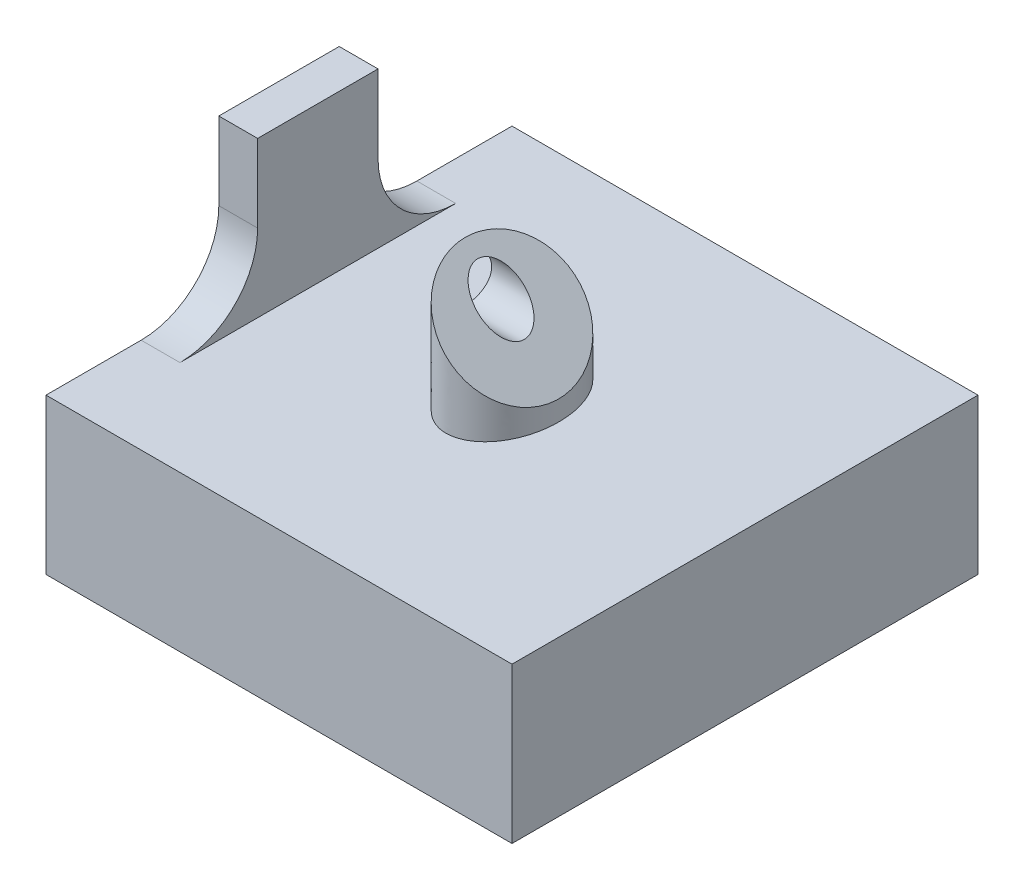
ISO-10303-21;
HEADER;
FILE_DESCRIPTION(('STEP AP214'),'2;1');
FILE_NAME('part.step','',(''),(''),'','','');
FILE_SCHEMA(('AUTOMOTIVE_DESIGN { 1 0 10303 214 1 1 1 1 }'));
ENDSEC;
DATA;
#1=APPLICATION_CONTEXT('core data for automotive mechanical design processes');
#2=APPLICATION_PROTOCOL_DEFINITION('international standard','automotive_design',2000,#1);
#3=PRODUCT_CONTEXT('',#1,'mechanical');
#4=PRODUCT('Part','Part','',(#3));
#5=PRODUCT_RELATED_PRODUCT_CATEGORY('part','',(#4));
#6=PRODUCT_DEFINITION_FORMATION('','',#4);
#7=PRODUCT_DEFINITION_CONTEXT('part definition',#1,'design');
#8=PRODUCT_DEFINITION('design','',#6,#7);
#9=PRODUCT_DEFINITION_SHAPE('','',#8);
#10=(LENGTH_UNIT() NAMED_UNIT(*) SI_UNIT(.MILLI.,.METRE.));
#11=(NAMED_UNIT(*) PLANE_ANGLE_UNIT() SI_UNIT($,.RADIAN.));
#12=(NAMED_UNIT(*) SI_UNIT($,.STERADIAN.) SOLID_ANGLE_UNIT());
#13=UNCERTAINTY_MEASURE_WITH_UNIT(LENGTH_MEASURE(1.E-05),#10,'distance_accuracy_value','');
#14=(GEOMETRIC_REPRESENTATION_CONTEXT(3) GLOBAL_UNCERTAINTY_ASSIGNED_CONTEXT((#13)) GLOBAL_UNIT_ASSIGNED_CONTEXT((#10,
#11,#12)) REPRESENTATION_CONTEXT('',''));
#15=CARTESIAN_POINT('',(0.,0.,0.));
#16=DIRECTION('',(0.,0.,1.));
#17=DIRECTION('',(1.,0.,0.));
#18=AXIS2_PLACEMENT_3D('',#15,#16,#17);
#19=CARTESIAN_POINT('',(0.,20.,0.));
#20=DIRECTION('',(0.,1.,0.));
#21=DIRECTION('',(0.,0.,1.));
#22=AXIS2_PLACEMENT_3D('',#19,#20,#21);
#23=PLANE('',#22);
#24=CARTESIAN_POINT('',(0.,20.,0.));
#25=DIRECTION('',(0.,1.,0.));
#26=DIRECTION('',(0.,0.,-1.));
#27=AXIS2_PLACEMENT_3D('',#24,#25,#26);
#28=ELLIPSE('',#27,8.5,6.01040764008565);
#29=CARTESIAN_POINT('',(0.,20.,-8.5));
#30=VERTEX_POINT('',#29);
#31=EDGE_CURVE('E151',#30,#30,#28,.T.);
#32=ORIENTED_EDGE('',*,*,#31,.F.);
#33=EDGE_LOOP('',(#32));
#34=FACE_BOUND('',#33,.T.);
#35=DIRECTION('',(0.,0.,1.));
#36=VECTOR('',#35,1.);
#37=CARTESIAN_POINT('',(-30.,20.,-30.));
#38=LINE('',#37,#36);
#39=CARTESIAN_POINT('',(-30.,20.,-30.));
#40=VERTEX_POINT('',#39);
#41=CARTESIAN_POINT('',(-30.,20.,-17.75));
#42=VERTEX_POINT('',#41);
#43=EDGE_CURVE('E155',#40,#42,#38,.T.);
#44=ORIENTED_EDGE('',*,*,#43,.T.);
#45=DIRECTION('',(-1.,0.,0.));
#46=VECTOR('',#45,1.);
#47=CARTESIAN_POINT('',(0.,20.,-17.75));
#48=LINE('',#47,#46);
#49=CARTESIAN_POINT('',(-25.,20.,-17.75));
#50=VERTEX_POINT('',#49);
#51=EDGE_CURVE('E247',#42,#50,#48,.F.);
#52=ORIENTED_EDGE('',*,*,#51,.T.);
#53=DIRECTION('',(0.,0.,-1.));
#54=VECTOR('',#53,1.);
#55=CARTESIAN_POINT('',(-25.,20.,7.75));
#56=LINE('',#55,#54);
#57=CARTESIAN_POINT('',(-25.,20.,17.75));
#58=VERTEX_POINT('',#57);
#59=EDGE_CURVE('E135',#58,#50,#56,.T.);
#60=ORIENTED_EDGE('',*,*,#59,.F.);
#61=DIRECTION('',(1.,0.,0.));
#62=VECTOR('',#61,1.);
#63=CARTESIAN_POINT('',(0.,20.,17.75));
#64=LINE('',#63,#62);
#65=CARTESIAN_POINT('',(-30.,20.,17.75));
#66=VERTEX_POINT('',#65);
#67=EDGE_CURVE('E246',#58,#66,#64,.F.);
#68=ORIENTED_EDGE('',*,*,#67,.T.);
#69=CARTESIAN_POINT('',(-30.,20.,30.));
#70=VERTEX_POINT('',#69);
#71=EDGE_CURVE('E159',#66,#70,#38,.T.);
#72=ORIENTED_EDGE('',*,*,#71,.T.);
#73=DIRECTION('',(1.,0.,0.));
#74=VECTOR('',#73,1.);
#75=CARTESIAN_POINT('',(-30.,20.,30.));
#76=LINE('',#75,#74);
#77=CARTESIAN_POINT('',(30.,20.,30.));
#78=VERTEX_POINT('',#77);
#79=EDGE_CURVE('E158',#70,#78,#76,.T.);
#80=ORIENTED_EDGE('',*,*,#79,.T.);
#81=DIRECTION('',(0.,0.,-1.));
#82=VECTOR('',#81,1.);
#83=CARTESIAN_POINT('',(30.,20.,-30.));
#84=LINE('',#83,#82);
#85=CARTESIAN_POINT('',(30.,20.,-30.));
#86=VERTEX_POINT('',#85);
#87=EDGE_CURVE('E161',#78,#86,#84,.T.);
#88=ORIENTED_EDGE('',*,*,#87,.T.);
#89=DIRECTION('',(-1.,0.,0.));
#90=VECTOR('',#89,1.);
#91=CARTESIAN_POINT('',(-30.,20.,-30.));
#92=LINE('',#91,#90);
#93=EDGE_CURVE('E163',#86,#40,#92,.T.);
#94=ORIENTED_EDGE('',*,*,#93,.T.);
#95=EDGE_LOOP('',(#44,#52,#60,#68,#72,#80,#88,#94));
#96=FACE_BOUND('',#95,.T.);
#97=ADVANCED_FACE('F40',(#34,#96),#23,.T.);
#98=CARTESIAN_POINT('',(-30.,20.,-30.));
#99=DIRECTION('',(1.,0.,0.));
#100=DIRECTION('',(0.,0.,-1.));
#101=AXIS2_PLACEMENT_3D('',#98,#99,#100);
#102=PLANE('',#101);
#103=DIRECTION('',(0.,0.,1.));
#104=VECTOR('',#103,1.);
#105=CARTESIAN_POINT('',(-30.,0.,-30.));
#106=LINE('',#105,#104);
#107=CARTESIAN_POINT('',(-30.,0.,-30.));
#108=VERTEX_POINT('',#107);
#109=CARTESIAN_POINT('',(-30.,0.,30.));
#110=VERTEX_POINT('',#109);
#111=EDGE_CURVE('E154',#108,#110,#106,.T.);
#112=ORIENTED_EDGE('',*,*,#111,.T.);
#113=DIRECTION('',(0.,-1.,0.));
#114=VECTOR('',#113,1.);
#115=CARTESIAN_POINT('',(-30.,20.,30.));
#116=LINE('',#115,#114);
#117=EDGE_CURVE('E181',#70,#110,#116,.T.);
#118=ORIENTED_EDGE('',*,*,#117,.F.);
#119=ORIENTED_EDGE('',*,*,#71,.F.);
#120=CARTESIAN_POINT('',(-30.,30.,17.75));
#121=DIRECTION('',(1.,0.,0.));
#122=DIRECTION('',(0.,0.,-1.));
#123=AXIS2_PLACEMENT_3D('',#120,#121,#122);
#124=CIRCLE('',#123,10.);
#125=CARTESIAN_POINT('',(-30.,30.,7.75));
#126=VERTEX_POINT('',#125);
#127=EDGE_CURVE('E12',#66,#126,#124,.T.);
#128=ORIENTED_EDGE('',*,*,#127,.T.);
#129=DIRECTION('',(0.,-1.,0.));
#130=VECTOR('',#129,1.);
#131=CARTESIAN_POINT('',(-30.,40.,7.75));
#132=LINE('',#131,#130);
#133=CARTESIAN_POINT('',(-30.,40.,7.75));
#134=VERTEX_POINT('',#133);
#135=EDGE_CURVE('E121',#134,#126,#132,.T.);
#136=ORIENTED_EDGE('',*,*,#135,.F.);
#137=DIRECTION('',(0.,0.,1.));
#138=VECTOR('',#137,1.);
#139=CARTESIAN_POINT('',(-30.,40.,7.75));
#140=LINE('',#139,#138);
#141=CARTESIAN_POINT('',(-30.,40.,-7.75));
#142=VERTEX_POINT('',#141);
#143=EDGE_CURVE('E127',#142,#134,#140,.T.);
#144=ORIENTED_EDGE('',*,*,#143,.F.);
#145=DIRECTION('',(0.,-1.,0.));
#146=VECTOR('',#145,1.);
#147=CARTESIAN_POINT('',(-30.,40.,-7.75));
#148=LINE('',#147,#146);
#149=CARTESIAN_POINT('',(-30.,30.,-7.75));
#150=VERTEX_POINT('',#149);
#151=EDGE_CURVE('E235',#142,#150,#148,.T.);
#152=ORIENTED_EDGE('',*,*,#151,.T.);
#153=CARTESIAN_POINT('',(-30.,30.,-17.75));
#154=DIRECTION('',(1.,0.,0.));
#155=DIRECTION('',(0.,0.,-1.));
#156=AXIS2_PLACEMENT_3D('',#153,#154,#155);
#157=CIRCLE('',#156,10.);
#158=EDGE_CURVE('E245',#150,#42,#157,.T.);
#159=ORIENTED_EDGE('',*,*,#158,.T.);
#160=ORIENTED_EDGE('',*,*,#43,.F.);
#161=DIRECTION('',(0.,-1.,0.));
#162=VECTOR('',#161,1.);
#163=CARTESIAN_POINT('',(-30.,20.,-30.));
#164=LINE('',#163,#162);
#165=EDGE_CURVE('E165',#40,#108,#164,.T.);
#166=ORIENTED_EDGE('',*,*,#165,.T.);
#167=EDGE_LOOP('',(#112,#118,#119,#128,#136,#144,#152,#159,#160,#166));
#168=FACE_BOUND('',#167,.T.);
#169=ADVANCED_FACE('F138',(#168),#102,.F.);
#170=CARTESIAN_POINT('',(-30.,20.,30.));
#171=DIRECTION('',(0.,0.,-1.));
#172=DIRECTION('',(-1.,0.,0.));
#173=AXIS2_PLACEMENT_3D('',#170,#171,#172);
#174=PLANE('',#173);
#175=DIRECTION('',(1.,0.,0.));
#176=VECTOR('',#175,1.);
#177=CARTESIAN_POINT('',(-30.,0.,30.));
#178=LINE('',#177,#176);
#179=CARTESIAN_POINT('',(30.,0.,30.));
#180=VERTEX_POINT('',#179);
#181=EDGE_CURVE('E167',#110,#180,#178,.T.);
#182=ORIENTED_EDGE('',*,*,#181,.T.);
#183=DIRECTION('',(0.,-1.,0.));
#184=VECTOR('',#183,1.);
#185=CARTESIAN_POINT('',(30.,20.,30.));
#186=LINE('',#185,#184);
#187=EDGE_CURVE('E178',#78,#180,#186,.T.);
#188=ORIENTED_EDGE('',*,*,#187,.F.);
#189=ORIENTED_EDGE('',*,*,#79,.F.);
#190=ORIENTED_EDGE('',*,*,#117,.T.);
#191=EDGE_LOOP('',(#182,#188,#189,#190));
#192=FACE_BOUND('',#191,.T.);
#193=ADVANCED_FACE('F265',(#192),#174,.F.);
#194=CARTESIAN_POINT('',(30.,20.,-30.));
#195=DIRECTION('',(-1.,0.,0.));
#196=DIRECTION('',(0.,0.,1.));
#197=AXIS2_PLACEMENT_3D('',#194,#195,#196);
#198=PLANE('',#197);
#199=DIRECTION('',(0.,0.,-1.));
#200=VECTOR('',#199,1.);
#201=CARTESIAN_POINT('',(30.,0.,-30.));
#202=LINE('',#201,#200);
#203=CARTESIAN_POINT('',(30.,0.,-30.));
#204=VERTEX_POINT('',#203);
#205=EDGE_CURVE('E169',#180,#204,#202,.T.);
#206=ORIENTED_EDGE('',*,*,#205,.T.);
#207=DIRECTION('',(0.,-1.,0.));
#208=VECTOR('',#207,1.);
#209=CARTESIAN_POINT('',(30.,20.,-30.));
#210=LINE('',#209,#208);
#211=EDGE_CURVE('E175',#86,#204,#210,.T.);
#212=ORIENTED_EDGE('',*,*,#211,.F.);
#213=ORIENTED_EDGE('',*,*,#87,.F.);
#214=ORIENTED_EDGE('',*,*,#187,.T.);
#215=EDGE_LOOP('',(#206,#212,#213,#214));
#216=FACE_BOUND('',#215,.T.);
#217=ADVANCED_FACE('F276',(#216),#198,.F.);
#218=CARTESIAN_POINT('',(-30.,20.,-30.));
#219=DIRECTION('',(0.,0.,1.));
#220=DIRECTION('',(1.,0.,0.));
#221=AXIS2_PLACEMENT_3D('',#218,#219,#220);
#222=PLANE('',#221);
#223=DIRECTION('',(-1.,0.,0.));
#224=VECTOR('',#223,1.);
#225=CARTESIAN_POINT('',(-30.,0.,-30.));
#226=LINE('',#225,#224);
#227=EDGE_CURVE('E171',#204,#108,#226,.T.);
#228=ORIENTED_EDGE('',*,*,#227,.T.);
#229=ORIENTED_EDGE('',*,*,#165,.F.);
#230=ORIENTED_EDGE('',*,*,#93,.F.);
#231=ORIENTED_EDGE('',*,*,#211,.T.);
#232=EDGE_LOOP('',(#228,#229,#230,#231));
#233=FACE_BOUND('',#232,.T.);
#234=ADVANCED_FACE('F272',(#233),#222,.F.);
#235=CARTESIAN_POINT('',(0.,0.,0.));
#236=DIRECTION('',(0.,1.,0.));
#237=DIRECTION('',(0.,0.,1.));
#238=AXIS2_PLACEMENT_3D('',#235,#236,#237);
#239=PLANE('',#238);
#240=CARTESIAN_POINT('',(0.,0.,0.));
#241=DIRECTION('',(0.,1.,0.));
#242=DIRECTION('',(0.,0.,1.));
#243=AXIS2_PLACEMENT_3D('',#240,#241,#242);
#244=CIRCLE('',#243,2.99999999999999);
#245=CARTESIAN_POINT('',(0.,0.,2.99999999999999));
#246=VERTEX_POINT('',#245);
#247=EDGE_CURVE('E142',#246,#246,#244,.T.);
#248=ORIENTED_EDGE('',*,*,#247,.T.);
#249=EDGE_LOOP('',(#248));
#250=FACE_BOUND('',#249,.T.);
#251=ORIENTED_EDGE('',*,*,#111,.F.);
#252=ORIENTED_EDGE('',*,*,#227,.F.);
#253=ORIENTED_EDGE('',*,*,#205,.F.);
#254=ORIENTED_EDGE('',*,*,#181,.F.);
#255=EDGE_LOOP('',(#251,#252,#253,#254));
#256=FACE_BOUND('',#255,.T.);
#257=ADVANCED_FACE('F269',(#250,#256),#239,.F.);
#258=CARTESIAN_POINT('',(-6.01040764008564,36.0104076400857,0.));
#259=CARTESIAN_POINT('',(-6.01040764008565,20.,0.));
#260=CARTESIAN_POINT('',(-6.01040764008564,36.0104076400857,-17.));
#261=CARTESIAN_POINT('',(-6.01040764008564,20.,-17.));
#262=CARTESIAN_POINT('',(6.01040764008565,23.9895923599143,-17.));
#263=CARTESIAN_POINT('',(6.01040764008565,20.,-17.));
#264=CARTESIAN_POINT('',(6.01040764008565,23.9895923599143,0.));
#265=CARTESIAN_POINT('',(6.01040764008565,20.,0.));
#266=CARTESIAN_POINT('',(6.01040764008564,23.9895923599143,17.));
#267=CARTESIAN_POINT('',(6.01040764008564,20.,17.));
#268=CARTESIAN_POINT('',(-6.01040764008564,36.0104076400857,17.));
#269=CARTESIAN_POINT('',(-6.01040764008565,20.,17.));
#270=CARTESIAN_POINT('',(-6.01040764008564,36.0104076400857,0.));
#271=CARTESIAN_POINT('',(-6.01040764008565,20.,0.));
#272=(BOUNDED_SURFACE() B_SPLINE_SURFACE(3,1,((#258,#259),(#260,#261),(#262,#263),(#264,#265),
(#266,#267),(#268,#269),(#270,#271)),.UNSPECIFIED.,.T.,.F.,.F.) B_SPLINE_SURFACE_WITH_KNOTS((4,
3,4),(2,2),(0.,0.5,1.),(0.,1.),
.UNSPECIFIED.) GEOMETRIC_REPRESENTATION_ITEM() RATIONAL_B_SPLINE_SURFACE(((1.,1.),
(0.333333333333333,0.333333333333333),(0.333333333333333,0.333333333333333),(1.,1.),
(0.333333333333333,0.333333333333333),(0.333333333333333,0.333333333333333),(1.,1.))) REPRESENTATION_ITEM('') SURFACE());
#273=CARTESIAN_POINT('',(-6.01040764008564,34.5961940777126,0.));
#274=CARTESIAN_POINT('',(-6.01040988941348,34.5961963270404,0.221293380989083));
#275=CARTESIAN_POINT('',(-6.00429583049665,34.5900822681236,0.442540904981482));
#276=CARTESIAN_POINT('',(-5.97988075353075,34.5656671911577,0.883740814844157));
#277=CARTESIAN_POINT('',(-5.96157811611005,34.547364553737,1.10369302470139));
#278=CARTESIAN_POINT('',(-5.91287257758799,34.4986590152149,1.54108324112852));
#279=CARTESIAN_POINT('',(-5.88245964805662,34.4682460856835,1.75851900990467));
#280=CARTESIAN_POINT('',(-5.80972033764572,34.3955067752726,2.18937338529535));
#281=CARTESIAN_POINT('',(-5.76739354098444,34.3531799786114,2.40279185143277));
#282=CARTESIAN_POINT('',(-5.66728373661177,34.2530701742387,2.84092962690104));
#283=CARTESIAN_POINT('',(-5.60854537644019,34.1943318140671,3.0652136518266));
#284=CARTESIAN_POINT('',(-5.47791478107347,34.0637012187004,3.50599646142617));
#285=CARTESIAN_POINT('',(-5.40602171694425,33.9918081545712,3.72249475445867));
#286=CARTESIAN_POINT('',(-5.24960694148113,33.8353933791081,4.14612366321582));
#287=CARTESIAN_POINT('',(-5.16508726185124,33.7508736994782,4.3532557790467));
#288=CARTESIAN_POINT('',(-4.98398001002763,33.5697664476546,4.75678631907114));
#289=CARTESIAN_POINT('',(-4.88738823239929,33.4731746700262,4.95318096832256));
#290=CARTESIAN_POINT('',(-4.68286710929988,33.2686535469268,5.33372456208937));
#291=CARTESIAN_POINT('',(-4.57493999878973,33.1607264364167,5.51787590893865));
#292=CARTESIAN_POINT('',(-4.34849806173418,32.9342844993611,5.8726686944372));
#293=CARTESIAN_POINT('',(-4.2299830697414,32.8157695073683,6.04330992189724));
#294=CARTESIAN_POINT('',(-3.98321381578757,32.5690002534145,6.36986025664869));
#295=CARTESIAN_POINT('',(-3.85495990073288,32.4407463383598,6.5257698882449));
#296=CARTESIAN_POINT('',(-3.58961789560644,32.1754043332334,6.82175882941588));
#297=CARTESIAN_POINT('',(-3.45252960893065,32.0383160465576,6.96183778649659));
#298=CARTESIAN_POINT('',(-3.17052127034278,31.7563077079697,7.22514195208459));
#299=CARTESIAN_POINT('',(-3.02560262052262,31.6113890581495,7.348370163998));
#300=CARTESIAN_POINT('',(-2.72888964618484,31.3146760838118,7.57716625893501));
#301=CARTESIAN_POINT('',(-2.5770929584498,31.1628793960767,7.6827280125862));
#302=CARTESIAN_POINT('',(-2.26777737264762,30.8535638102745,7.87537158171805));
#303=CARTESIAN_POINT('',(-2.11025948452899,30.6960459221559,7.96245664045032));
#304=CARTESIAN_POINT('',(-1.79059364458631,30.3763800822132,8.11755236860421));
#305=CARTESIAN_POINT('',(-1.62844562071701,30.2142320583439,8.18556274104388));
#306=CARTESIAN_POINT('',(-1.30067807399745,29.8864645116244,8.3020225509917));
#307=CARTESIAN_POINT('',(-1.13505862310305,29.72084506073,8.35047239353026));
#308=CARTESIAN_POINT('',(-0.801518686921084,29.387305124548,8.42746957337003));
#309=CARTESIAN_POINT('',(-0.633598150863822,29.2193845884907,8.45601647082191));
#310=CARTESIAN_POINT('',(-0.296684801496315,28.8824712391232,8.49299964401763));
#311=CARTESIAN_POINT('',(-0.127692192925067,28.713478630552,8.50143965024513));
#312=CARTESIAN_POINT('',(0.210253755235611,28.3755326823913,8.49815937983957));
#313=CARTESIAN_POINT('',(0.37920706097091,28.206579376656,8.48643212209913));
#314=CARTESIAN_POINT('',(0.715783797929106,27.8700026396978,8.44289125598337));
#315=CARTESIAN_POINT('',(0.883407463439136,27.7023789741878,8.4110812696075));
#316=CARTESIAN_POINT('',(1.216166708182,27.3696197294449,8.32760376226224));
#317=CARTESIAN_POINT('',(1.3813022486411,27.2044841889858,8.27593593216968));
#318=CARTESIAN_POINT('',(1.70790549421302,26.8778809434139,8.15311124232917));
#319=CARTESIAN_POINT('',(1.86937326708724,26.7164131705397,8.08195474294881));
#320=CARTESIAN_POINT('',(2.18749976253722,26.3982866750897,7.92065637034144));
#321=CARTESIAN_POINT('',(2.34415837874152,26.2416280588854,7.83051407752279));
#322=CARTESIAN_POINT('',(2.65152067545436,25.9342657621725,7.6319042836799));
#323=CARTESIAN_POINT('',(2.80222544796182,25.7835609896651,7.52344016250989));
#324=CARTESIAN_POINT('',(3.09669059220651,25.4890958454204,7.28890533405452));
#325=CARTESIAN_POINT('',(3.24044854151344,25.3453378961135,7.16282854383142));
#326=CARTESIAN_POINT('',(3.51991644558225,25.0658699920446,6.89401784957366));
#327=CARTESIAN_POINT('',(3.65562785159988,24.930158586027,6.75128696309959));
#328=CARTESIAN_POINT('',(3.9180681451073,24.6677182925196,6.45016212026686));
#329=CARTESIAN_POINT('',(4.04479689274688,24.54098954488,6.29176792013936));
#330=CARTESIAN_POINT('',(4.28836625378568,24.2974201838412,5.96044755080964));
#331=CARTESIAN_POINT('',(4.40520705307447,24.1805793845524,5.7875216549195));
#332=CARTESIAN_POINT('',(4.62817501307117,23.9576114245557,5.42836069531511));
#333=CARTESIAN_POINT('',(4.73430193692697,23.8514845006999,5.24212533752339));
#334=CARTESIAN_POINT('',(4.93506615967417,23.6507202779527,4.85770838665705));
#335=CARTESIAN_POINT('',(5.02970557180049,23.5560808658264,4.65952900086676));
#336=CARTESIAN_POINT('',(5.20687565015427,23.3789107874726,4.25253079358292));
#337=CARTESIAN_POINT('',(5.28940210973756,23.2963843278893,4.04370830966289));
#338=CARTESIAN_POINT('',(5.44170696132367,23.1440794763032,3.61700942509826));
#339=CARTESIAN_POINT('',(5.51148756650727,23.0742988711196,3.39913460437486));
#340=CARTESIAN_POINT('',(5.63782238956286,22.947964048064,2.95584572663265));
#341=CARTESIAN_POINT('',(5.69437659081387,22.891409846813,2.73043166014005));
#342=CARTESIAN_POINT('',(5.79385570294,22.7919307346869,2.27367041086497));
#343=CARTESIAN_POINT('',(5.83678080915478,22.7490056284721,2.04232331316932));
#344=CARTESIAN_POINT('',(5.90869866116337,22.6770877764635,1.57533117900256));
#345=CARTESIAN_POINT('',(5.93769102525527,22.6480954123716,1.3396860249653));
#346=CARTESIAN_POINT('',(5.98153551718124,22.6042509204457,0.865779291051588));
#347=CARTESIAN_POINT('',(5.99638764515466,22.5893987924722,0.627517711200917));
#348=CARTESIAN_POINT('',(6.01184586260625,22.5739405750206,0.15007861480554));
#349=CARTESIAN_POINT('',(6.01245234232533,22.5733340953016,-0.089098876469454));
#350=CARTESIAN_POINT('',(5.99941584905181,22.5863705885751,-0.566679368141116));
#351=CARTESIAN_POINT('',(5.98577267153537,22.6000137660915,-0.805082357372171));
#352=CARTESIAN_POINT('',(5.94433357452959,22.6414528630973,-1.27941516367743));
#353=CARTESIAN_POINT('',(5.91653767282495,22.6692487648019,-1.51534498385912));
#354=CARTESIAN_POINT('',(5.84698468232586,22.738801755301,-1.98309518305011));
#355=CARTESIAN_POINT('',(5.80522516696702,22.7805612706599,-2.21491484042664));
#356=CARTESIAN_POINT('',(5.70805999796461,22.8777264396623,-2.67267448651763));
#357=CARTESIAN_POINT('',(5.65265907563272,22.9331273619942,-2.89861648383086));
#358=CARTESIAN_POINT('',(5.52858599586081,23.0572004417661,-3.343139464297));
#359=CARTESIAN_POINT('',(5.45991139591123,23.1258750417157,-3.56171908398172));
#360=CARTESIAN_POINT('',(5.30978742621707,23.2759990114098,-3.98991481613687));
#361=CARTESIAN_POINT('',(5.22833833885311,23.3574480987738,-4.19953112661134));
#362=CARTESIAN_POINT('',(5.05324168938011,23.5325447482468,-4.60831902232343));
#363=CARTESIAN_POINT('',(4.95959389886237,23.6261925387645,-4.80749041189224));
#364=CARTESIAN_POINT('',(4.76076838165695,23.8250180559699,-5.19396519577447));
#365=CARTESIAN_POINT('',(4.65559083445752,23.9301956031694,-5.38126877476713));
#366=CARTESIAN_POINT('',(4.43443226887453,24.1513541687524,-5.74271252682497));
#367=CARTESIAN_POINT('',(4.31844929653256,24.2673371410943,-5.91685030874897));
#368=CARTESIAN_POINT('',(4.07656282178548,24.5092236158414,-6.25062860325469));
#369=CARTESIAN_POINT('',(3.95066276687628,24.6351236707506,-6.4102741126366));
#370=CARTESIAN_POINT('',(3.68977777365873,24.8960086639682,-6.71402917153896));
#371=CARTESIAN_POINT('',(3.55479116417588,25.030995273451,-6.85813585044964));
#372=CARTESIAN_POINT('',(3.2767165934033,25.3090698442236,-7.1297518927569));
#373=CARTESIAN_POINT('',(3.13362881123983,25.4521576263871,-7.25726162292562));
#374=CARTESIAN_POINT('',(2.84036376079515,25.7454226768317,-7.49478316889738));
#375=CARTESIAN_POINT('',(2.69018636485371,25.8956000727732,-7.60479466945982));
#376=CARTESIAN_POINT('',(2.38381457227812,26.2019718653488,-7.80653327402106));
#377=CARTESIAN_POINT('',(2.2276202693485,26.3581661682784,-7.89826066263093));
#378=CARTESIAN_POINT('',(1.91029418024547,26.6754922573814,-8.06279594454666));
#379=CARTESIAN_POINT('',(1.74916150757762,26.8366249300493,-8.13560041846791));
#380=CARTESIAN_POINT('',(1.42318805092538,27.1625983867015,-8.26172852756671));
#381=CARTESIAN_POINT('',(1.25834856965856,27.3274378679683,-8.31505889653965));
#382=CARTESIAN_POINT('',(0.926048227516119,27.6597382101108,-8.40190318625572));
#383=CARTESIAN_POINT('',(0.758586885843098,27.8271995517838,-8.43541342763466));
#384=CARTESIAN_POINT('',(0.422267055484667,28.1635193821422,-8.48236325662698));
#385=CARTESIAN_POINT('',(0.253408597760797,28.3323778398661,-8.49580328782546));
#386=CARTESIAN_POINT('',(-0.0845116279921031,28.670298065619,-8.502518618387));
#387=CARTESIAN_POINT('',(-0.253573399502887,28.8393598371298,-8.49579356736183));
#388=CARTESIAN_POINT('',(-0.59069272595999,29.1764791635869,-8.46222605224219));
#389=CARTESIAN_POINT('',(-0.758750296497653,29.3445367341246,-8.43538390131057));
#390=CARTESIAN_POINT('',(-1.09269962402584,29.6784860616528,-8.36176664252942));
#391=CARTESIAN_POINT('',(-1.25859098043962,29.8443774180665,-8.31498790032836));
#392=CARTESIAN_POINT('',(-1.58693987506659,30.1727263126935,-8.20184921540911));
#393=CARTESIAN_POINT('',(-1.7493985818699,30.3351850194968,-8.13549605544813));
#394=CARTESIAN_POINT('',(-2.06981869308664,30.6556051307135,-7.98365897251711));
#395=CARTESIAN_POINT('',(-2.22777919818846,30.8135656358154,-7.89817125388492));
#396=CARTESIAN_POINT('',(-2.53804274088515,31.1238291785121,-7.70868244858547));
#397=CARTESIAN_POINT('',(-2.69034590340117,31.2761323410281,-7.60468177100138));
#398=CARTESIAN_POINT('',(-2.98821396815981,31.5740004057867,-7.37890643827875));
#399=CARTESIAN_POINT('',(-3.13377894728786,31.7195653849148,-7.25713198601213));
#400=CARTESIAN_POINT('',(-3.41713540866243,32.0029218462893,-6.99667600356816));
#401=CARTESIAN_POINT('',(-3.55492701217737,32.1407134498043,-6.85799473725203));
#402=CARTESIAN_POINT('',(-3.82177297130649,32.4075594089334,-6.5646948109681));
#403=CARTESIAN_POINT('',(-3.95082645264364,32.5366128902706,-6.41007456014649));
#404=CARTESIAN_POINT('',(-4.19922037954316,32.7850068171701,-6.08606377430643));
#405=CARTESIAN_POINT('',(-4.31856417123417,32.9043506088611,-5.91667836965871));
#406=CARTESIAN_POINT('',(-4.54678292488782,33.1325693625147,-5.56422933606251));
#407=CARTESIAN_POINT('',(-4.65565397899822,33.2414404166252,-5.38116064619267));
#408=CARTESIAN_POINT('',(-4.86210144936841,33.4478878869953,-5.00270487738521));
#409=CARTESIAN_POINT('',(-4.95967800956735,33.5454644471943,-4.8073179554825));
#410=CARTESIAN_POINT('',(-5.14287928315219,33.7286657207791,-4.40553569049289));
#411=CARTESIAN_POINT('',(-5.22849942573373,33.8142858633607,-4.19913617886341));
#412=CARTESIAN_POINT('',(-5.38713350909092,33.9729199467179,-3.77687001389042));
#413=CARTESIAN_POINT('',(-5.46014757503988,34.0459340126668,-3.56100345457761));
#414=CARTESIAN_POINT('',(-5.5929971289594,34.1787835665863,-3.12150987662932));
#415=CARTESIAN_POINT('',(-5.65284337576157,34.2386298133885,-2.89788936764645));
#416=CARTESIAN_POINT('',(-5.75899433922558,34.3447807768525,-2.44438729371293));
#417=CARTESIAN_POINT('',(-5.805301941293,34.3910883789199,-2.21450707428787));
#418=CARTESIAN_POINT('',(-5.89966490463282,34.4854513422598,-1.65801197788273));
#419=CARTESIAN_POINT('',(-5.94115525031384,34.5269416879408,-1.32912772786224));
#420=CARTESIAN_POINT('',(-5.99652244414413,34.5823088817711,-0.666793746883536));
#421=CARTESIAN_POINT('',(-6.01040425181511,34.596190689442,-0.333344846744702));
#422=CARTESIAN_POINT('',(-6.01040764008564,34.5961940777126,0.));
#423=B_SPLINE_CURVE_WITH_KNOTS('',3,(#273,#274,#275,#276,#277,#278,#279,#280,#281,#282,#283,
#284,#285,#286,#287,#288,#289,#290,#291,#292,#293,#294,#295,#296,#297,#298,#299,#300,#301,#302,
#303,#304,#305,#306,#307,#308,#309,#310,#311,#312,#313,#314,#315,#316,#317,#318,#319,#320,#321,
#322,#323,#324,#325,#326,#327,#328,#329,#330,#331,#332,#333,#334,#335,#336,#337,#338,#339,#340,
#341,#342,#343,#344,#345,#346,#347,#348,#349,#350,#351,#352,#353,#354,#355,#356,#357,#358,#359,
#360,#361,#362,#363,#364,#365,#366,#367,#368,#369,#370,#371,#372,#373,#374,#375,#376,#377,#378,
#379,#380,#381,#382,#383,#384,#385,#386,#387,#388,#389,#390,#391,#392,#393,#394,#395,#396,#397,
#398,#399,#400,#401,#402,#403,#404,#405,#406,#407,#408,#409,#410,#411,#412,#413,#414,#415,#416,
#417,#418,#419,#420,#421,#422),.UNSPECIFIED.,.T.,.F.,(4,2,2,2,2,2,2,2,2,2,2,2,2,2,2,2,2,2,2,2,2,
2,2,2,2,2,2,2,2,2,2,2,2,2,2,2,2,2,2,2,2,2,2,2,2,2,2,2,2,2,2,2,2,2,2,2,2,2,2,2,2,2,2,2,2,2,2,2,2,
2,2,2,2,2,4),(0.,0.663632051222431,1.32735229003642,1.99162329676368,2.65591748874353,
3.37257536034767,4.08927840718741,4.80586625584073,5.52270443440951,6.239401540073,
6.95610984688367,7.67279263607381,8.38949138015388,9.10606221588992,9.82288115256056,
10.5395741602656,11.2562783258511,11.9729676502298,12.6896728127333,13.4062449927104,
14.1230652715054,14.8397563058489,15.5564584972335,16.2731474368766,16.9898522172193,
17.7064249300881,18.423245742401,19.1399368748389,19.856639162928,20.5733279742985,
21.2900326260722,22.0066052328802,22.7234261086167,23.440122397533,24.1568195870808,
24.8735065040678,25.5902130543166,26.306919597503,27.0236065074282,27.7403037040273,
28.4570000000066,29.1738209065874,29.890393544224,30.6070981652266,31.323786945673,
32.0404891473399,32.7571801934067,33.4740010920937,34.1905738913699,34.9072788427656,
35.6239679531735,36.3406699736823,37.0573608371133,37.7741811172147,38.4907532985126,
39.2074584609521,39.9241477827786,40.6408495578628,41.3575401762841,42.0743615001247,
42.7909347284394,43.5076502273034,44.2243498907805,44.9410413744038,45.6577216741995,
46.3744735745115,47.0909774140174,47.8077475847586,48.5245086198399,49.2415429188648,
49.9585700976159,50.6750092321416,51.3912955650419,52.39113601758,53.390796845305),.UNSPECIFIED.);
#424=CARTESIAN_POINT('',(-6.01040764008564,34.5961940777126,0.));
#425=VERTEX_POINT('',#424);
#426=EDGE_CURVE('E228',#425,#425,#423,.T.);
#427=CARTESIAN_POINT('',(-6.01040764008564,33.,0.));
#428=CARTESIAN_POINT('',(-6.01040421741058,32.9999929293866,-0.165715112778276));
#429=CARTESIAN_POINT('',(-6.00694790050172,32.9862216927083,-0.331490304854222));
#430=CARTESIAN_POINT('',(-5.99347600028463,32.9315775246803,-0.658283637544941));
#431=CARTESIAN_POINT('',(-5.98345686244442,32.8906899065018,-0.819299150819029));
#432=CARTESIAN_POINT('',(-5.95792373451185,32.7832100884078,-1.13181819328137));
#433=CARTESIAN_POINT('',(-5.94241620533496,32.7166481040244,-1.28333266124222));
#434=CARTESIAN_POINT('',(-5.90750255704619,32.5598231930487,-1.57303752693712));
#435=CARTESIAN_POINT('',(-5.88809629913539,32.4695594226121,-1.71122745004377));
#436=CARTESIAN_POINT('',(-5.84700302769154,32.2659568962179,-1.97318487865312));
#437=CARTESIAN_POINT('',(-5.82528076067313,32.1522259124005,-2.09664199412243));
#438=CARTESIAN_POINT('',(-5.78219975933476,31.9057548709482,-2.32294983807676));
#439=CARTESIAN_POINT('',(-5.76084107150003,31.7730124027328,-2.4257979494487));
#440=CARTESIAN_POINT('',(-5.72056500915768,31.4897126298792,-2.60954037982359));
#441=CARTESIAN_POINT('',(-5.70169142941258,31.3389074695863,-2.69006304342129));
#442=CARTESIAN_POINT('',(-5.66909784437898,31.0253466275458,-2.82449066185297));
#443=CARTESIAN_POINT('',(-5.65537695300778,30.8625930062768,-2.87840019371952));
#444=CARTESIAN_POINT('',(-5.63507000231677,30.5332570096709,-2.95697596988832));
#445=CARTESIAN_POINT('',(-5.62834411041174,30.3668204598814,-2.98221630976236));
#446=CARTESIAN_POINT('',(-5.62241182881396,30.03195067275,-3.00451748984461));
#447=CARTESIAN_POINT('',(-5.6232041071481,29.863517794373,-3.00158332165017));
#448=CARTESIAN_POINT('',(-5.63208002831735,29.5341042224551,-2.96810339514721));
#449=CARTESIAN_POINT('',(-5.63997224124863,29.3730438731361,-2.93828251538521));
#450=CARTESIAN_POINT('',(-5.66181341184992,29.0582885706537,-2.85302839830545));
#451=CARTESIAN_POINT('',(-5.67576288277241,28.9045942428647,-2.79759299055438));
#452=CARTESIAN_POINT('',(-5.7082663979693,28.6069828307253,-2.66205485725803));
#453=CARTESIAN_POINT('',(-5.72686928967278,28.4631915411288,-2.58168812627033));
#454=CARTESIAN_POINT('',(-5.76650434364007,28.1908743646904,-2.39874609585677));
#455=CARTESIAN_POINT('',(-5.78753694010883,28.0623512147199,-2.29616682402391));
#456=CARTESIAN_POINT('',(-5.83041734420561,27.8201571795112,-2.06803836706512));
#457=CARTESIAN_POINT('',(-5.85227060811992,27.70705108142,-1.9418897664229));
#458=CARTESIAN_POINT('',(-5.8937675165352,27.5034997589214,-1.67213523999381));
#459=CARTESIAN_POINT('',(-5.91341110566185,27.4130551023387,-1.52852887690402));
#460=CARTESIAN_POINT('',(-5.94841039013852,27.2572527352112,-1.22726168944721));
#461=CARTESIAN_POINT('',(-5.96375366628573,27.1919674849113,-1.06956185854965));
#462=CARTESIAN_POINT('',(-5.98839118406566,27.0889825029677,-0.74495376923973));
#463=CARTESIAN_POINT('',(-5.99768655651242,27.0512776142889,-0.578047238595676));
#464=CARTESIAN_POINT('',(-6.00905352092328,27.0053550796506,-0.244390785250394));
#465=CARTESIAN_POINT('',(-6.01130555806312,26.9964007029633,-0.0777482467374388));
#466=CARTESIAN_POINT('',(-6.00885882028634,27.0062079170416,0.254656799565055));
#467=CARTESIAN_POINT('',(-6.00416068005522,27.0249669770347,0.420419386323948));
#468=CARTESIAN_POINT('',(-5.98842969546555,27.0890795391205,0.743864599811495));
#469=CARTESIAN_POINT('',(-5.9774901501732,27.1340415566099,0.901629765215815));
#470=CARTESIAN_POINT('',(-5.95046338569842,27.2488282948599,1.20736262352524));
#471=CARTESIAN_POINT('',(-5.93437568050112,27.3186553630896,1.35532938981467));
#472=CARTESIAN_POINT('',(-5.8983637349653,27.4825519524131,1.64009421660247));
#473=CARTESIAN_POINT('',(-5.87837810701603,27.5770188411572,1.77665561495226));
#474=CARTESIAN_POINT('',(-5.83683182481233,27.7870036474228,2.03224350644733));
#475=CARTESIAN_POINT('',(-5.81527088547847,27.9025253808586,2.15126681396077));
#476=CARTESIAN_POINT('',(-5.77232630049037,28.1547820484567,2.37147484548099));
#477=CARTESIAN_POINT('',(-5.75096058331099,28.2919753641065,2.47213882605088));
#478=CARTESIAN_POINT('',(-5.71144914274484,28.5817371476393,2.64902574279356));
#479=CARTESIAN_POINT('',(-5.69330329640435,28.7343050280815,2.7252496123242));
#480=CARTESIAN_POINT('',(-5.66253580804283,29.0498058470345,2.85057644684617));
#481=CARTESIAN_POINT('',(-5.64988550264256,29.2126798014167,2.89982049240717));
#482=CARTESIAN_POINT('',(-5.63160181317994,29.5447775878234,2.97011033092428));
#483=CARTESIAN_POINT('',(-5.62596672387838,29.7139998664083,2.99116297666159));
#484=CARTESIAN_POINT('',(-5.62250909937305,30.0484260515156,3.00413384147046));
#485=CARTESIAN_POINT('',(-5.62445348293231,30.2135950652737,2.99692122689891));
#486=CARTESIAN_POINT('',(-5.63539641879207,30.5403542829829,2.95552032101591));
#487=CARTESIAN_POINT('',(-5.64439487117798,30.7019445375905,2.92133241178546));
#488=CARTESIAN_POINT('',(-5.66227920207277,30.9375102745605,2.85092430130212));
#489=CARTESIAN_POINT('',(-5.66894638482415,31.0146836734466,2.82437061355036));
#490=CARTESIAN_POINT('',(-5.68353392425813,31.1665128663391,2.76511788360314));
#491=CARTESIAN_POINT('',(-5.69145399157092,31.2411692368672,2.73242026010199));
#492=CARTESIAN_POINT('',(-5.70832027074093,31.387462814432,2.66112157607901));
#493=CARTESIAN_POINT('',(-5.7172662459364,31.4591007125923,2.62252187639649));
#494=CARTESIAN_POINT('',(-5.73594043675926,31.5989847417981,2.5396591908835));
#495=CARTESIAN_POINT('',(-5.74566937751047,31.6672276317752,2.49539093230569));
#496=CARTESIAN_POINT('',(-5.77617550271189,31.8697840720326,2.35196347332461));
#497=CARTESIAN_POINT('',(-5.79779369489705,31.9979584730261,2.24411049920303));
#498=CARTESIAN_POINT('',(-5.84082056330374,32.2346156501427,2.00857292328779));
#499=CARTESIAN_POINT('',(-5.86222922965539,32.3430975028181,1.88088739200178));
#500=CARTESIAN_POINT('',(-5.89265137618105,32.4897615442346,1.67581512683579));
#501=CARTESIAN_POINT('',(-5.90259800142076,32.5363429203686,1.60444167846757));
#502=CARTESIAN_POINT('',(-5.92156703175926,32.623284727149,1.45794996175038));
#503=CARTESIAN_POINT('',(-5.93059026578188,32.6636507540091,1.38283514370376));
#504=CARTESIAN_POINT('',(-5.94746666314588,32.7378742910991,1.22935305540569));
#505=CARTESIAN_POINT('',(-5.95532012564735,32.7717334660516,1.1509866233072));
#506=CARTESIAN_POINT('',(-5.96964387913644,32.8326873809283,0.991550884185513));
#507=CARTESIAN_POINT('',(-5.97611406198548,32.8597815920258,0.910481366419495));
#508=CARTESIAN_POINT('',(-5.99108996187965,32.921928119935,0.69411813533958));
#509=CARTESIAN_POINT('',(-5.99828919784652,32.9511511101272,0.557003388261358));
#510=CARTESIAN_POINT('',(-6.00794930367788,32.9901893036832,0.279939909175635));
#511=CARTESIAN_POINT('',(-6.01041053146374,33.0000059730521,0.139991392045603));
#512=CARTESIAN_POINT('',(-6.01040764008564,33.,0.));
#513=B_SPLINE_CURVE_WITH_KNOTS('',3,(#427,#428,#429,#430,#431,#432,#433,#434,#435,#436,#437,
#438,#439,#440,#441,#442,#443,#444,#445,#446,#447,#448,#449,#450,#451,#452,#453,#454,#455,#456,
#457,#458,#459,#460,#461,#462,#463,#464,#465,#466,#467,#468,#469,#470,#471,#472,#473,#474,#475,
#476,#477,#478,#479,#480,#481,#482,#483,#484,#485,#486,#487,#488,#489,#490,#491,#492,#493,#494,
#495,#496,#497,#498,#499,#500,#501,#502,#503,#504,#505,#506,#507,#508,#509,#510,#511,#512),
.UNSPECIFIED.,.T.,.F.,(4,2,2,2,2,2,2,2,2,2,2,2,2,2,2,2,2,2,2,2,2,2,2,2,2,2,2,2,2,2,2,2,2,2,2,2,
2,2,2,2,2,2,4),(0.,0.496650625415146,0.993570467663019,1.4899072727217,1.98626175103589,
2.49170413724967,2.99721066837518,3.51068635929545,4.02407370982543,4.52698857544016,
5.02981434270476,5.51947620272203,6.00917956158585,6.50425655569624,6.99942216073792,
7.50952053426329,8.01963168797712,8.53120119732736,9.04267502784697,9.54093318916952,
10.0391458527022,10.5300991664285,11.0210988425522,11.5205674367596,12.0201266432712,
12.5321830037813,13.0442198067383,13.5535529154146,14.062762192626,14.5564378339209,
15.050106482866,15.2955354118348,15.5409077383742,15.7862235745906,16.0317692777812,
16.5360112250205,17.0402768116991,17.2974360880798,17.55436245054,17.8112229928161,
18.0681036079567,18.4876915627561,18.9072478195545),.UNSPECIFIED.);
#514=CARTESIAN_POINT('',(-6.01040764008564,33.,0.));
#515=VERTEX_POINT('',#514);
#516=EDGE_CURVE('E149',#515,#515,#513,.T.);
#517=ORIENTED_EDGE('',*,*,#426,.F.);
#518=EDGE_LOOP('',(#517));
#519=FACE_BOUND('',#518,.T.);
#520=ORIENTED_EDGE('',*,*,#516,.F.);
#521=EDGE_LOOP('',(#520));
#522=FACE_BOUND('',#521,.T.);
#523=ORIENTED_EDGE('',*,*,#31,.T.);
#524=EDGE_LOOP('',(#523));
#525=FACE_BOUND('',#524,.T.);
#526=ADVANCED_FACE('F192',(#519,#522,#525),#272,.T.);
#527=CARTESIAN_POINT('',(-30.,30.,0.));
#528=DIRECTION('',(1.,0.,0.));
#529=DIRECTION('',(0.,0.,-1.));
#530=AXIS2_PLACEMENT_3D('',#527,#528,#529);
#531=CYLINDRICAL_SURFACE('',#530,3.);
#532=CARTESIAN_POINT('',(-1.41421356237308,30.,0.));
#533=DIRECTION('',(-0.707106781186549,-0.707106781186546,0.));
#534=DIRECTION('',(0.707106781186546,-0.707106781186549,0.));
#535=AXIS2_PLACEMENT_3D('',#532,#533,#534);
#536=ELLIPSE('',#535,4.24264068711928,3.);
#537=CARTESIAN_POINT('',(1.58578643762691,27.,0.));
#538=VERTEX_POINT('',#537);
#539=EDGE_CURVE('E44',#538,#538,#536,.F.);
#540=ORIENTED_EDGE('',*,*,#539,.T.);
#541=EDGE_LOOP('',(#540));
#542=FACE_BOUND('',#541,.T.);
#543=ORIENTED_EDGE('',*,*,#516,.T.);
#544=EDGE_LOOP('',(#543));
#545=FACE_BOUND('',#544,.T.);
#546=ADVANCED_FACE('F197',(#542,#545),#531,.F.);
#547=CARTESIAN_POINT('',(0.,0.,0.));
#548=DIRECTION('',(0.,1.,0.));
#549=DIRECTION('',(0.,0.,1.));
#550=AXIS2_PLACEMENT_3D('',#547,#548,#549);
#551=CYLINDRICAL_SURFACE('',#550,2.99999999999999);
#552=ORIENTED_EDGE('',*,*,#247,.F.);
#553=EDGE_LOOP('',(#552));
#554=FACE_BOUND('',#553,.T.);
#555=CARTESIAN_POINT('',(0.,20.,0.));
#556=DIRECTION('',(0.,1.,0.));
#557=DIRECTION('',(0.,0.,1.));
#558=AXIS2_PLACEMENT_3D('',#555,#556,#557);
#559=CIRCLE('',#558,2.99999999999999);
#560=CARTESIAN_POINT('',(0.,20.,2.99999999999999));
#561=VERTEX_POINT('',#560);
#562=EDGE_CURVE('E139',#561,#561,#559,.T.);
#563=ORIENTED_EDGE('',*,*,#562,.T.);
#564=EDGE_LOOP('',(#563));
#565=FACE_BOUND('',#564,.T.);
#566=ADVANCED_FACE('F201',(#554,#565),#551,.F.);
#567=CARTESIAN_POINT('',(0.,20.,0.));
#568=DIRECTION('',(0.,1.,0.));
#569=DIRECTION('',(0.,0.,1.));
#570=AXIS2_PLACEMENT_3D('',#567,#568,#569);
#571=PLANE('',#570);
#572=ORIENTED_EDGE('',*,*,#562,.F.);
#573=EDGE_LOOP('',(#572));
#574=FACE_BOUND('',#573,.T.);
#575=ADVANCED_FACE('F205',(#574),#571,.F.);
#576=CARTESIAN_POINT('',(-30.,40.,7.75));
#577=DIRECTION('',(0.,0.,-1.));
#578=DIRECTION('',(-1.,0.,0.));
#579=AXIS2_PLACEMENT_3D('',#576,#577,#578);
#580=PLANE('',#579);
#581=ORIENTED_EDGE('',*,*,#135,.T.);
#582=DIRECTION('',(1.,0.,0.));
#583=VECTOR('',#582,1.);
#584=CARTESIAN_POINT('',(-30.,30.,7.75));
#585=LINE('',#584,#583);
#586=CARTESIAN_POINT('',(-25.,30.,7.75));
#587=VERTEX_POINT('',#586);
#588=EDGE_CURVE('E250',#126,#587,#585,.T.);
#589=ORIENTED_EDGE('',*,*,#588,.T.);
#590=DIRECTION('',(0.,-1.,0.));
#591=VECTOR('',#590,1.);
#592=CARTESIAN_POINT('',(-25.,40.,7.75));
#593=LINE('',#592,#591);
#594=CARTESIAN_POINT('',(-25.,40.,7.75));
#595=VERTEX_POINT('',#594);
#596=EDGE_CURVE('E123',#595,#587,#593,.T.);
#597=ORIENTED_EDGE('',*,*,#596,.F.);
#598=DIRECTION('',(1.,0.,0.));
#599=VECTOR('',#598,1.);
#600=CARTESIAN_POINT('',(-30.,40.,7.75));
#601=LINE('',#600,#599);
#602=EDGE_CURVE('E118',#134,#595,#601,.T.);
#603=ORIENTED_EDGE('',*,*,#602,.F.);
#604=EDGE_LOOP('',(#581,#589,#597,#603));
#605=FACE_BOUND('',#604,.T.);
#606=ADVANCED_FACE('F120',(#605),#580,.F.);
#607=CARTESIAN_POINT('',(-25.,40.,7.75));
#608=DIRECTION('',(-1.,0.,0.));
#609=DIRECTION('',(0.,0.,1.));
#610=AXIS2_PLACEMENT_3D('',#607,#608,#609);
#611=PLANE('',#610);
#612=ORIENTED_EDGE('',*,*,#59,.T.);
#613=CARTESIAN_POINT('',(-25.,30.,-17.75));
#614=DIRECTION('',(-1.,0.,0.));
#615=DIRECTION('',(0.,0.,1.));
#616=AXIS2_PLACEMENT_3D('',#613,#614,#615);
#617=CIRCLE('',#616,10.);
#618=CARTESIAN_POINT('',(-25.,30.,-7.75));
#619=VERTEX_POINT('',#618);
#620=EDGE_CURVE('E244',#50,#619,#617,.T.);
#621=ORIENTED_EDGE('',*,*,#620,.T.);
#622=DIRECTION('',(0.,-1.,0.));
#623=VECTOR('',#622,1.);
#624=CARTESIAN_POINT('',(-25.,40.,-7.75));
#625=LINE('',#624,#623);
#626=CARTESIAN_POINT('',(-25.,40.,-7.75));
#627=VERTEX_POINT('',#626);
#628=EDGE_CURVE('E144',#627,#619,#625,.T.);
#629=ORIENTED_EDGE('',*,*,#628,.F.);
#630=DIRECTION('',(0.,0.,-1.));
#631=VECTOR('',#630,1.);
#632=CARTESIAN_POINT('',(-25.,40.,7.75));
#633=LINE('',#632,#631);
#634=EDGE_CURVE('E126',#595,#627,#633,.T.);
#635=ORIENTED_EDGE('',*,*,#634,.F.);
#636=ORIENTED_EDGE('',*,*,#596,.T.);
#637=CARTESIAN_POINT('',(-25.,30.,17.75));
#638=DIRECTION('',(-1.,0.,0.));
#639=DIRECTION('',(0.,0.,1.));
#640=AXIS2_PLACEMENT_3D('',#637,#638,#639);
#641=CIRCLE('',#640,10.);
#642=EDGE_CURVE('E49',#587,#58,#641,.T.);
#643=ORIENTED_EDGE('',*,*,#642,.T.);
#644=EDGE_LOOP('',(#612,#621,#629,#635,#636,#643));
#645=FACE_BOUND('',#644,.T.);
#646=ADVANCED_FACE('F212',(#645),#611,.F.);
#647=CARTESIAN_POINT('',(-30.,40.,-7.75));
#648=DIRECTION('',(0.,0.,1.));
#649=DIRECTION('',(1.,0.,0.));
#650=AXIS2_PLACEMENT_3D('',#647,#648,#649);
#651=PLANE('',#650);
#652=ORIENTED_EDGE('',*,*,#628,.T.);
#653=DIRECTION('',(-1.,0.,0.));
#654=VECTOR('',#653,1.);
#655=CARTESIAN_POINT('',(-30.,30.,-7.75));
#656=LINE('',#655,#654);
#657=EDGE_CURVE('E184',#619,#150,#656,.T.);
#658=ORIENTED_EDGE('',*,*,#657,.T.);
#659=ORIENTED_EDGE('',*,*,#151,.F.);
#660=DIRECTION('',(-1.,0.,0.));
#661=VECTOR('',#660,1.);
#662=CARTESIAN_POINT('',(-30.,40.,-7.75));
#663=LINE('',#662,#661);
#664=EDGE_CURVE('E132',#627,#142,#663,.T.);
#665=ORIENTED_EDGE('',*,*,#664,.F.);
#666=EDGE_LOOP('',(#652,#658,#659,#665));
#667=FACE_BOUND('',#666,.T.);
#668=ADVANCED_FACE('F215',(#667),#651,.F.);
#669=CARTESIAN_POINT('',(0.,40.,0.));
#670=DIRECTION('',(0.,-1.,0.));
#671=DIRECTION('',(0.,0.,-1.));
#672=AXIS2_PLACEMENT_3D('',#669,#670,#671);
#673=PLANE('',#672);
#674=ORIENTED_EDGE('',*,*,#143,.T.);
#675=ORIENTED_EDGE('',*,*,#602,.T.);
#676=ORIENTED_EDGE('',*,*,#634,.T.);
#677=ORIENTED_EDGE('',*,*,#664,.T.);
#678=EDGE_LOOP('',(#674,#675,#676,#677));
#679=FACE_BOUND('',#678,.T.);
#680=ADVANCED_FACE('F130',(#679),#673,.F.);
#681=CARTESIAN_POINT('',(-30.,30.,-17.75));
#682=DIRECTION('',(-1.,0.,0.));
#683=DIRECTION('',(0.,0.,1.));
#684=AXIS2_PLACEMENT_3D('',#681,#682,#683);
#685=CYLINDRICAL_SURFACE('',#684,10.);
#686=ORIENTED_EDGE('',*,*,#620,.F.);
#687=ORIENTED_EDGE('',*,*,#51,.F.);
#688=ORIENTED_EDGE('',*,*,#158,.F.);
#689=ORIENTED_EDGE('',*,*,#657,.F.);
#690=EDGE_LOOP('',(#686,#687,#688,#689));
#691=FACE_BOUND('',#690,.T.);
#692=ADVANCED_FACE('F222',(#691),#685,.F.);
#693=CARTESIAN_POINT('',(-30.,30.,17.75));
#694=DIRECTION('',(1.,0.,0.));
#695=DIRECTION('',(0.,0.,-1.));
#696=AXIS2_PLACEMENT_3D('',#693,#694,#695);
#697=CYLINDRICAL_SURFACE('',#696,10.);
#698=ORIENTED_EDGE('',*,*,#127,.F.);
#699=ORIENTED_EDGE('',*,*,#67,.F.);
#700=ORIENTED_EDGE('',*,*,#642,.F.);
#701=ORIENTED_EDGE('',*,*,#588,.F.);
#702=EDGE_LOOP('',(#698,#699,#700,#701));
#703=FACE_BOUND('',#702,.T.);
#704=ADVANCED_FACE('F42',(#703),#697,.F.);
#705=CARTESIAN_POINT('',(7.42462120245874,21.1611652351681,-13.8828538079819));
#706=DIRECTION('',(-0.707106781186549,-0.707106781186546,0.));
#707=DIRECTION('',(0.707106781186546,-0.707106781186549,0.));
#708=AXIS2_PLACEMENT_3D('',#705,#706,#707);
#709=PLANE('',#708);
#710=ORIENTED_EDGE('',*,*,#426,.T.);
#711=EDGE_LOOP('',(#710));
#712=FACE_BOUND('',#711,.T.);
#713=ORIENTED_EDGE('',*,*,#539,.F.);
#714=EDGE_LOOP('',(#713));
#715=FACE_BOUND('',#714,.T.);
#716=ADVANCED_FACE('F223',(#712,#715),#709,.F.);
#717=CLOSED_SHELL('',(#97,#169,#193,#217,#234,#257,#526,#546,#566,#575,#606,#646,#668,#680,#692,
#704,#716));
#718=MANIFOLD_SOLID_BREP('B2',#717);
#719=ADVANCED_BREP_SHAPE_REPRESENTATION('',(#18,#718),#14);
#720=SHAPE_DEFINITION_REPRESENTATION(#9,#719);
ENDSEC;
END-ISO-10303-21;
